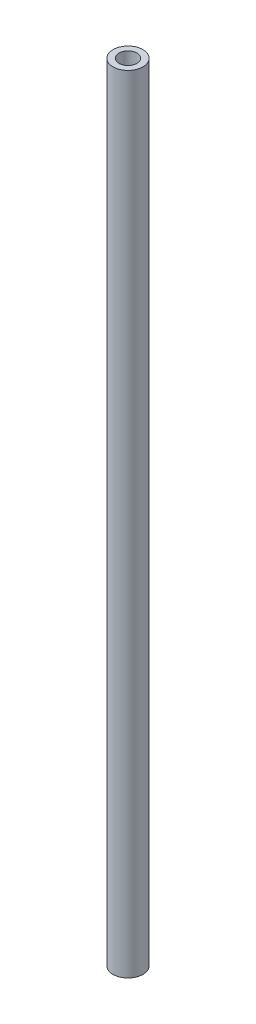
ISO-10303-21;
HEADER;
FILE_DESCRIPTION(('STEP AP214'),'2;1');
FILE_NAME('part.step','',(''),(''),'','','');
FILE_SCHEMA(('AUTOMOTIVE_DESIGN { 1 0 10303 214 1 1 1 1 }'));
ENDSEC;
DATA;
#1=APPLICATION_CONTEXT('core data for automotive mechanical design processes');
#2=APPLICATION_PROTOCOL_DEFINITION('international standard','automotive_design',2000,#1);
#3=PRODUCT_CONTEXT('',#1,'mechanical');
#4=PRODUCT('Part','Part','',(#3));
#5=PRODUCT_RELATED_PRODUCT_CATEGORY('part','',(#4));
#6=PRODUCT_DEFINITION_FORMATION('','',#4);
#7=PRODUCT_DEFINITION_CONTEXT('part definition',#1,'design');
#8=PRODUCT_DEFINITION('design','',#6,#7);
#9=PRODUCT_DEFINITION_SHAPE('','',#8);
#10=(LENGTH_UNIT() NAMED_UNIT(*) SI_UNIT(.MILLI.,.METRE.));
#11=(NAMED_UNIT(*) PLANE_ANGLE_UNIT() SI_UNIT($,.RADIAN.));
#12=(NAMED_UNIT(*) SI_UNIT($,.STERADIAN.) SOLID_ANGLE_UNIT());
#13=UNCERTAINTY_MEASURE_WITH_UNIT(LENGTH_MEASURE(1.E-05),#10,'distance_accuracy_value','');
#14=(GEOMETRIC_REPRESENTATION_CONTEXT(3) GLOBAL_UNCERTAINTY_ASSIGNED_CONTEXT((#13)) GLOBAL_UNIT_ASSIGNED_CONTEXT((#10,
#11,#12)) REPRESENTATION_CONTEXT('',''));
#15=CARTESIAN_POINT('',(0.,0.,0.));
#16=DIRECTION('',(0.,0.,1.));
#17=DIRECTION('',(1.,0.,0.));
#18=AXIS2_PLACEMENT_3D('',#15,#16,#17);
#19=CARTESIAN_POINT('',(0.,105.,0.));
#20=DIRECTION('',(0.,1.,0.));
#21=DIRECTION('',(0.,0.,1.));
#22=AXIS2_PLACEMENT_3D('',#19,#20,#21);
#23=PLANE('',#22);
#24=CARTESIAN_POINT('',(0.,105.,0.));
#25=DIRECTION('',(0.,1.,0.));
#26=DIRECTION('',(0.,0.,1.));
#27=AXIS2_PLACEMENT_3D('',#24,#25,#26);
#28=CIRCLE('',#27,2.);
#29=CARTESIAN_POINT('',(0.,105.,2.));
#30=VERTEX_POINT('',#29);
#31=EDGE_CURVE('E10',#30,#30,#28,.T.);
#32=ORIENTED_EDGE('',*,*,#31,.T.);
#33=EDGE_LOOP('',(#32));
#34=FACE_BOUND('',#33,.T.);
#35=CARTESIAN_POINT('',(0.,105.,0.));
#36=DIRECTION('',(0.,1.,0.));
#37=DIRECTION('',(0.,0.,1.));
#38=AXIS2_PLACEMENT_3D('',#35,#36,#37);
#39=CIRCLE('',#38,1.2);
#40=CARTESIAN_POINT('',(0.,105.,1.2));
#41=VERTEX_POINT('',#40);
#42=EDGE_CURVE('E41',#41,#41,#39,.T.);
#43=ORIENTED_EDGE('',*,*,#42,.F.);
#44=EDGE_LOOP('',(#43));
#45=FACE_BOUND('',#44,.T.);
#46=ADVANCED_FACE('F30',(#34,#45),#23,.T.);
#47=CARTESIAN_POINT('',(0.,0.,0.));
#48=DIRECTION('',(0.,1.,0.));
#49=DIRECTION('',(0.,0.,1.));
#50=AXIS2_PLACEMENT_3D('',#47,#48,#49);
#51=PLANE('',#50);
#52=CARTESIAN_POINT('',(0.,0.,0.));
#53=DIRECTION('',(0.,1.,0.));
#54=DIRECTION('',(0.,0.,1.));
#55=AXIS2_PLACEMENT_3D('',#52,#53,#54);
#56=CIRCLE('',#55,2.);
#57=CARTESIAN_POINT('',(0.,0.,2.));
#58=VERTEX_POINT('',#57);
#59=EDGE_CURVE('E34',#58,#58,#56,.T.);
#60=ORIENTED_EDGE('',*,*,#59,.F.);
#61=EDGE_LOOP('',(#60));
#62=FACE_BOUND('',#61,.T.);
#63=CARTESIAN_POINT('',(0.,0.,0.));
#64=DIRECTION('',(0.,1.,0.));
#65=DIRECTION('',(0.,0.,1.));
#66=AXIS2_PLACEMENT_3D('',#63,#64,#65);
#67=CIRCLE('',#66,1.2);
#68=CARTESIAN_POINT('',(0.,0.,1.2));
#69=VERTEX_POINT('',#68);
#70=EDGE_CURVE('E43',#69,#69,#67,.T.);
#71=ORIENTED_EDGE('',*,*,#70,.T.);
#72=EDGE_LOOP('',(#71));
#73=FACE_BOUND('',#72,.T.);
#74=ADVANCED_FACE('F53',(#62,#73),#51,.F.);
#75=CARTESIAN_POINT('',(0.,105.,0.));
#76=DIRECTION('',(0.,-1.,0.));
#77=DIRECTION('',(0.,0.,-1.));
#78=AXIS2_PLACEMENT_3D('',#75,#76,#77);
#79=CYLINDRICAL_SURFACE('',#78,2.);
#80=ORIENTED_EDGE('',*,*,#31,.F.);
#81=EDGE_LOOP('',(#80));
#82=FACE_BOUND('',#81,.T.);
#83=ORIENTED_EDGE('',*,*,#59,.T.);
#84=EDGE_LOOP('',(#83));
#85=FACE_BOUND('',#84,.T.);
#86=ADVANCED_FACE('F32',(#82,#85),#79,.T.);
#87=CARTESIAN_POINT('',(0.,105.,0.));
#88=DIRECTION('',(0.,-1.,0.));
#89=DIRECTION('',(0.,0.,-1.));
#90=AXIS2_PLACEMENT_3D('',#87,#88,#89);
#91=CYLINDRICAL_SURFACE('',#90,1.2);
#92=ORIENTED_EDGE('',*,*,#42,.T.);
#93=EDGE_LOOP('',(#92));
#94=FACE_BOUND('',#93,.T.);
#95=ORIENTED_EDGE('',*,*,#70,.F.);
#96=EDGE_LOOP('',(#95));
#97=FACE_BOUND('',#96,.T.);
#98=ADVANCED_FACE('F49',(#94,#97),#91,.F.);
#99=CLOSED_SHELL('',(#46,#74,#86,#98));
#100=MANIFOLD_SOLID_BREP('B2',#99);
#101=ADVANCED_BREP_SHAPE_REPRESENTATION('',(#18,#100),#14);
#102=SHAPE_DEFINITION_REPRESENTATION(#9,#101);
ENDSEC;
END-ISO-10303-21;
